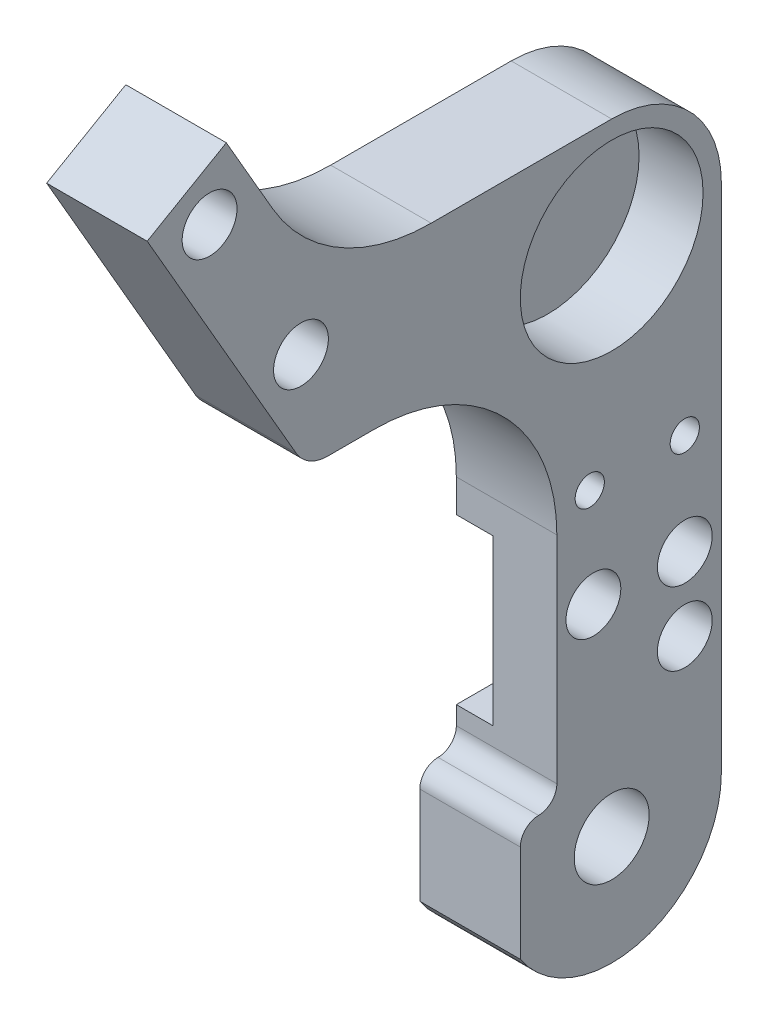
ISO-10303-21;
HEADER;
FILE_DESCRIPTION(('STEP AP214'),'2;1');
FILE_NAME('part.step','',(''),(''),'','','');
FILE_SCHEMA(('AUTOMOTIVE_DESIGN { 1 0 10303 214 1 1 1 1 }'));
ENDSEC;
DATA;
#1=APPLICATION_CONTEXT('core data for automotive mechanical design processes');
#2=APPLICATION_PROTOCOL_DEFINITION('international standard','automotive_design',2000,#1);
#3=PRODUCT_CONTEXT('',#1,'mechanical');
#4=PRODUCT('Part','Part','',(#3));
#5=PRODUCT_RELATED_PRODUCT_CATEGORY('part','',(#4));
#6=PRODUCT_DEFINITION_FORMATION('','',#4);
#7=PRODUCT_DEFINITION_CONTEXT('part definition',#1,'design');
#8=PRODUCT_DEFINITION('design','',#6,#7);
#9=PRODUCT_DEFINITION_SHAPE('','',#8);
#10=(LENGTH_UNIT() NAMED_UNIT(*) SI_UNIT(.MILLI.,.METRE.));
#11=(NAMED_UNIT(*) PLANE_ANGLE_UNIT() SI_UNIT($,.RADIAN.));
#12=(NAMED_UNIT(*) SI_UNIT($,.STERADIAN.) SOLID_ANGLE_UNIT());
#13=UNCERTAINTY_MEASURE_WITH_UNIT(LENGTH_MEASURE(1.E-05),#10,'distance_accuracy_value','');
#14=(GEOMETRIC_REPRESENTATION_CONTEXT(3) GLOBAL_UNCERTAINTY_ASSIGNED_CONTEXT((#13)) GLOBAL_UNIT_ASSIGNED_CONTEXT((#10,
#11,#12)) REPRESENTATION_CONTEXT('',''));
#15=CARTESIAN_POINT('',(0.,0.,0.));
#16=DIRECTION('',(0.,0.,1.));
#17=DIRECTION('',(1.,0.,0.));
#18=AXIS2_PLACEMENT_3D('',#15,#16,#17);
#19=CARTESIAN_POINT('',(0.,0.,0.));
#20=DIRECTION('',(-1.,0.,0.));
#21=DIRECTION('',(0.,0.,1.));
#22=AXIS2_PLACEMENT_3D('',#19,#20,#21);
#23=PLANE('',#22);
#24=DIRECTION('',(0.,0.,-1.));
#25=VECTOR('',#24,1.);
#26=CARTESIAN_POINT('',(0.,14.,-6.));
#27=LINE('',#26,#25);
#28=CARTESIAN_POINT('',(0.,14.,3.));
#29=VERTEX_POINT('',#28);
#30=CARTESIAN_POINT('',(0.,14.,-6.));
#31=VERTEX_POINT('',#30);
#32=EDGE_CURVE('E184',#29,#31,#27,.T.);
#33=ORIENTED_EDGE('',*,*,#32,.F.);
#34=DIRECTION('',(0.,-1.,0.));
#35=VECTOR('',#34,1.);
#36=CARTESIAN_POINT('',(0.,15.7901891737369,3.));
#37=LINE('',#36,#35);
#38=CARTESIAN_POINT('',(0.,15.7901891737369,3.));
#39=VERTEX_POINT('',#38);
#40=EDGE_CURVE('E295',#39,#29,#37,.T.);
#41=ORIENTED_EDGE('',*,*,#40,.F.);
#42=CARTESIAN_POINT('',(0.,15.7901891737369,13.));
#43=DIRECTION('',(-1.,0.,0.));
#44=DIRECTION('',(0.,0.,1.));
#45=AXIS2_PLACEMENT_3D('',#42,#43,#44);
#46=CIRCLE('',#45,10.);
#47=CARTESIAN_POINT('',(0.,25.7901891737369,13.));
#48=VERTEX_POINT('',#47);
#49=EDGE_CURVE('E292',#48,#39,#46,.T.);
#50=ORIENTED_EDGE('',*,*,#49,.F.);
#51=DIRECTION('',(0.,0.,-1.));
#52=VECTOR('',#51,1.);
#53=CARTESIAN_POINT('',(0.,25.7901891737369,15.5280127018922));
#54=LINE('',#53,#52);
#55=CARTESIAN_POINT('',(0.,25.7901891737369,15.5280127018922));
#56=VERTEX_POINT('',#55);
#57=EDGE_CURVE('E290',#56,#48,#54,.T.);
#58=ORIENTED_EDGE('',*,*,#57,.F.);
#59=CARTESIAN_POINT('',(0.,27.7901891737369,15.5280127018922));
#60=DIRECTION('',(1.,0.,0.));
#61=DIRECTION('',(0.,0.,-1.));
#62=AXIS2_PLACEMENT_3D('',#59,#60,#61);
#63=CIRCLE('',#62,2.00000000000001);
#64=CARTESIAN_POINT('',(0.,26.7901891737369,17.260063509461));
#65=VERTEX_POINT('',#64);
#66=EDGE_CURVE('E288',#65,#56,#63,.T.);
#67=ORIENTED_EDGE('',*,*,#66,.F.);
#68=DIRECTION('',(0.,-0.866025403784436,-0.500000000000004));
#69=VECTOR('',#68,1.);
#70=CARTESIAN_POINT('',(0.,40.9150635094611,25.4150635094611));
#71=LINE('',#70,#69);
#72=CARTESIAN_POINT('',(0.,40.9150635094611,25.4150635094611));
#73=VERTEX_POINT('',#72);
#74=EDGE_CURVE('E286',#73,#65,#71,.T.);
#75=ORIENTED_EDGE('',*,*,#74,.F.);
#76=DIRECTION('',(0.,-0.500000000000004,0.866025403784436));
#77=VECTOR('',#76,1.);
#78=CARTESIAN_POINT('',(0.,43.4150635094611,21.0849364905389));
#79=LINE('',#78,#77);
#80=CARTESIAN_POINT('',(0.,43.4150635094611,21.0849364905389));
#81=VERTEX_POINT('',#80);
#82=EDGE_CURVE('E284',#81,#73,#79,.T.);
#83=ORIENTED_EDGE('',*,*,#82,.F.);
#84=DIRECTION('',(0.,0.866025403784437,0.500000000000003));
#85=VECTOR('',#84,1.);
#86=CARTESIAN_POINT('',(0.,39.,18.5358983848622));
#87=LINE('',#86,#85);
#88=CARTESIAN_POINT('',(0.,39.,18.5358983848622));
#89=VERTEX_POINT('',#88);
#90=EDGE_CURVE('E282',#89,#81,#87,.T.);
#91=ORIENTED_EDGE('',*,*,#90,.F.);
#92=CARTESIAN_POINT('',(0.,44.,9.87564434701784));
#93=DIRECTION('',(-1.,0.,0.));
#94=DIRECTION('',(0.,0.,1.));
#95=AXIS2_PLACEMENT_3D('',#92,#93,#94);
#96=CIRCLE('',#95,10.);
#97=CARTESIAN_POINT('',(0.,34.,9.87564434701784));
#98=VERTEX_POINT('',#97);
#99=EDGE_CURVE('E280',#98,#89,#96,.T.);
#100=ORIENTED_EDGE('',*,*,#99,.F.);
#101=DIRECTION('',(0.,0.,1.));
#102=VECTOR('',#101,1.);
#103=CARTESIAN_POINT('',(0.,34.,0.));
#104=LINE('',#103,#102);
#105=CARTESIAN_POINT('',(0.,34.,0.));
#106=VERTEX_POINT('',#105);
#107=EDGE_CURVE('E278',#106,#98,#104,.T.);
#108=ORIENTED_EDGE('',*,*,#107,.F.);
#109=CARTESIAN_POINT('',(0.,28.,0.));
#110=DIRECTION('',(1.,0.,0.));
#111=DIRECTION('',(0.,0.,-1.));
#112=AXIS2_PLACEMENT_3D('',#109,#110,#111);
#113=CIRCLE('',#112,6.);
#114=CARTESIAN_POINT('',(0.,28.,-6.));
#115=VERTEX_POINT('',#114);
#116=EDGE_CURVE('E276',#115,#106,#113,.T.);
#117=ORIENTED_EDGE('',*,*,#116,.F.);
#118=DIRECTION('',(0.,1.,0.));
#119=VECTOR('',#118,1.);
#120=CARTESIAN_POINT('',(0.,0.,-6.));
#121=LINE('',#120,#119);
#122=EDGE_CURVE('E274',#31,#115,#121,.T.);
#123=ORIENTED_EDGE('',*,*,#122,.F.);
#124=EDGE_LOOP('',(#33,#41,#50,#58,#67,#75,#83,#91,#100,#108,#117,#123));
#125=FACE_BOUND('',#124,.T.);
#126=CARTESIAN_POINT('',(0.,40.,22.));
#127=DIRECTION('',(1.,0.,0.));
#128=DIRECTION('',(0.,0.,-1.));
#129=AXIS2_PLACEMENT_3D('',#126,#127,#128);
#130=CIRCLE('',#129,1.5);
#131=CARTESIAN_POINT('',(0.,40.,20.5));
#132=VERTEX_POINT('',#131);
#133=EDGE_CURVE('E228',#132,#132,#130,.T.);
#134=ORIENTED_EDGE('',*,*,#133,.T.);
#135=EDGE_LOOP('',(#134));
#136=FACE_BOUND('',#135,.T.);
#137=CARTESIAN_POINT('',(0.,31.3397459621556,17.));
#138=DIRECTION('',(1.,0.,0.));
#139=DIRECTION('',(0.,0.,-1.));
#140=AXIS2_PLACEMENT_3D('',#137,#138,#139);
#141=CIRCLE('',#140,1.5);
#142=CARTESIAN_POINT('',(0.,31.3397459621556,15.5));
#143=VERTEX_POINT('',#142);
#144=EDGE_CURVE('E224',#143,#143,#141,.T.);
#145=ORIENTED_EDGE('',*,*,#144,.T.);
#146=EDGE_LOOP('',(#145));
#147=FACE_BOUND('',#146,.T.);
#148=CARTESIAN_POINT('',(0.,17.,-4.));
#149=DIRECTION('',(-1.,0.,0.));
#150=DIRECTION('',(0.,0.,1.));
#151=AXIS2_PLACEMENT_3D('',#148,#149,#150);
#152=CIRCLE('',#151,0.799999999999993);
#153=CARTESIAN_POINT('',(0.,17.,-3.20000000000001));
#154=VERTEX_POINT('',#153);
#155=EDGE_CURVE('E211',#154,#154,#152,.T.);
#156=ORIENTED_EDGE('',*,*,#155,.F.);
#157=EDGE_LOOP('',(#156));
#158=FACE_BOUND('',#157,.T.);
#159=CARTESIAN_POINT('',(0.,17.,1.2));
#160=DIRECTION('',(-1.,0.,0.));
#161=DIRECTION('',(0.,0.,1.));
#162=AXIS2_PLACEMENT_3D('',#159,#160,#161);
#163=CIRCLE('',#162,0.799999999999993);
#164=CARTESIAN_POINT('',(0.,17.,1.99999999999999));
#165=VERTEX_POINT('',#164);
#166=EDGE_CURVE('E205',#165,#165,#163,.T.);
#167=ORIENTED_EDGE('',*,*,#166,.F.);
#168=EDGE_LOOP('',(#167));
#169=FACE_BOUND('',#168,.T.);
#170=ADVANCED_FACE('F37',(#125,#136,#147,#158,#169),#23,.T.);
#171=CARTESIAN_POINT('',(5.5,0.,0.));
#172=DIRECTION('',(-1.,0.,0.));
#173=DIRECTION('',(0.,0.,1.));
#174=AXIS2_PLACEMENT_3D('',#171,#172,#173);
#175=PLANE('',#174);
#176=CARTESIAN_POINT('',(5.5,28.,0.));
#177=DIRECTION('',(1.,0.,0.));
#178=DIRECTION('',(0.,0.,-1.));
#179=AXIS2_PLACEMENT_3D('',#176,#177,#178);
#180=CIRCLE('',#179,5.);
#181=CARTESIAN_POINT('',(5.5,28.,-5.));
#182=VERTEX_POINT('',#181);
#183=EDGE_CURVE('E694',#182,#182,#180,.T.);
#184=ORIENTED_EDGE('',*,*,#183,.F.);
#185=EDGE_LOOP('',(#184));
#186=FACE_BOUND('',#185,.T.);
#187=CARTESIAN_POINT('',(5.5,17.,-4.));
#188=DIRECTION('',(1.,0.,0.));
#189=DIRECTION('',(0.,0.,-1.));
#190=AXIS2_PLACEMENT_3D('',#187,#188,#189);
#191=CIRCLE('',#190,0.799999999999988);
#192=CARTESIAN_POINT('',(5.5,17.,-4.79999999999999));
#193=VERTEX_POINT('',#192);
#194=EDGE_CURVE('E208',#193,#193,#191,.T.);
#195=ORIENTED_EDGE('',*,*,#194,.F.);
#196=EDGE_LOOP('',(#195));
#197=FACE_BOUND('',#196,.T.);
#198=CARTESIAN_POINT('',(5.5,11.5,-4.));
#199=DIRECTION('',(1.,0.,0.));
#200=DIRECTION('',(0.,0.,-1.));
#201=AXIS2_PLACEMENT_3D('',#198,#199,#200);
#202=CIRCLE('',#201,1.5);
#203=CARTESIAN_POINT('',(5.5,11.5,-5.5));
#204=VERTEX_POINT('',#203);
#205=EDGE_CURVE('E218',#204,#204,#202,.T.);
#206=ORIENTED_EDGE('',*,*,#205,.F.);
#207=EDGE_LOOP('',(#206));
#208=FACE_BOUND('',#207,.T.);
#209=CARTESIAN_POINT('',(5.5,31.3397459621556,17.));
#210=DIRECTION('',(1.,0.,0.));
#211=DIRECTION('',(0.,0.,-1.));
#212=AXIS2_PLACEMENT_3D('',#209,#210,#211);
#213=CIRCLE('',#212,1.5);
#214=CARTESIAN_POINT('',(5.5,31.3397459621556,15.5));
#215=VERTEX_POINT('',#214);
#216=EDGE_CURVE('E225',#215,#215,#213,.T.);
#217=ORIENTED_EDGE('',*,*,#216,.F.);
#218=EDGE_LOOP('',(#217));
#219=FACE_BOUND('',#218,.T.);
#220=CARTESIAN_POINT('',(5.5,0.,0.));
#221=DIRECTION('',(1.,0.,0.));
#222=DIRECTION('',(0.,0.,-1.));
#223=AXIS2_PLACEMENT_3D('',#220,#221,#222);
#224=CIRCLE('',#223,2.05);
#225=CARTESIAN_POINT('',(5.5,0.,-2.05));
#226=VERTEX_POINT('',#225);
#227=EDGE_CURVE('E237',#226,#226,#224,.T.);
#228=ORIENTED_EDGE('',*,*,#227,.F.);
#229=EDGE_LOOP('',(#228));
#230=FACE_BOUND('',#229,.T.);
#231=DIRECTION('',(0.,-1.,0.));
#232=VECTOR('',#231,1.);
#233=CARTESIAN_POINT('',(5.5,15.7901891737369,3.));
#234=LINE('',#233,#232);
#235=CARTESIAN_POINT('',(5.5,15.7901891737369,3.));
#236=VERTEX_POINT('',#235);
#237=CARTESIAN_POINT('',(5.5,4.,3.));
#238=VERTEX_POINT('',#237);
#239=EDGE_CURVE('E267',#236,#238,#234,.T.);
#240=ORIENTED_EDGE('',*,*,#239,.T.);
#241=CARTESIAN_POINT('',(5.5,4.,4.));
#242=DIRECTION('',(-1.,0.,0.));
#243=DIRECTION('',(0.,0.,1.));
#244=AXIS2_PLACEMENT_3D('',#241,#242,#243);
#245=CIRCLE('',#244,1.);
#246=CARTESIAN_POINT('',(5.5,3.,4.));
#247=VERTEX_POINT('',#246);
#248=EDGE_CURVE('E11',#238,#247,#245,.T.);
#249=ORIENTED_EDGE('',*,*,#248,.T.);
#250=CARTESIAN_POINT('',(5.5,2.,4.));
#251=DIRECTION('',(-1.,0.,0.));
#252=DIRECTION('',(0.,0.,1.));
#253=AXIS2_PLACEMENT_3D('',#250,#251,#252);
#254=CIRCLE('',#253,1.);
#255=CARTESIAN_POINT('',(5.5,2.,5.));
#256=VERTEX_POINT('',#255);
#257=EDGE_CURVE('E338',#247,#256,#254,.F.);
#258=ORIENTED_EDGE('',*,*,#257,.T.);
#259=DIRECTION('',(0.,-1.,0.));
#260=VECTOR('',#259,1.);
#261=CARTESIAN_POINT('',(5.5,3.,5.));
#262=LINE('',#261,#260);
#263=CARTESIAN_POINT('',(5.5,-3.3166247903554,5.));
#264=VERTEX_POINT('',#263);
#265=EDGE_CURVE('E269',#256,#264,#262,.T.);
#266=ORIENTED_EDGE('',*,*,#265,.T.);
#267=CARTESIAN_POINT('',(5.5,0.,0.));
#268=DIRECTION('',(1.,0.,0.));
#269=DIRECTION('',(0.,0.,1.));
#270=AXIS2_PLACEMENT_3D('',#267,#268,#269);
#271=CIRCLE('',#270,6.);
#272=CARTESIAN_POINT('',(5.5,0.,-6.));
#273=VERTEX_POINT('',#272);
#274=EDGE_CURVE('E243',#264,#273,#271,.T.);
#275=ORIENTED_EDGE('',*,*,#274,.T.);
#276=DIRECTION('',(0.,1.,0.));
#277=VECTOR('',#276,1.);
#278=CARTESIAN_POINT('',(5.5,0.,-6.));
#279=LINE('',#278,#277);
#280=CARTESIAN_POINT('',(5.5,28.,-6.));
#281=VERTEX_POINT('',#280);
#282=EDGE_CURVE('E246',#273,#281,#279,.T.);
#283=ORIENTED_EDGE('',*,*,#282,.T.);
#284=CARTESIAN_POINT('',(5.5,28.,0.));
#285=DIRECTION('',(1.,0.,0.));
#286=DIRECTION('',(0.,0.,-1.));
#287=AXIS2_PLACEMENT_3D('',#284,#285,#286);
#288=CIRCLE('',#287,6.);
#289=CARTESIAN_POINT('',(5.5,34.,0.));
#290=VERTEX_POINT('',#289);
#291=EDGE_CURVE('E249',#281,#290,#288,.T.);
#292=ORIENTED_EDGE('',*,*,#291,.T.);
#293=DIRECTION('',(0.,0.,1.));
#294=VECTOR('',#293,1.);
#295=CARTESIAN_POINT('',(5.5,34.,0.));
#296=LINE('',#295,#294);
#297=CARTESIAN_POINT('',(5.5,34.,9.87564434701784));
#298=VERTEX_POINT('',#297);
#299=EDGE_CURVE('E251',#290,#298,#296,.T.);
#300=ORIENTED_EDGE('',*,*,#299,.T.);
#301=CARTESIAN_POINT('',(5.5,44.,9.87564434701784));
#302=DIRECTION('',(-1.,0.,0.));
#303=DIRECTION('',(0.,0.,1.));
#304=AXIS2_PLACEMENT_3D('',#301,#302,#303);
#305=CIRCLE('',#304,10.);
#306=CARTESIAN_POINT('',(5.5,39.,18.5358983848622));
#307=VERTEX_POINT('',#306);
#308=EDGE_CURVE('E253',#298,#307,#305,.T.);
#309=ORIENTED_EDGE('',*,*,#308,.T.);
#310=DIRECTION('',(0.,0.866025403784437,0.500000000000003));
#311=VECTOR('',#310,1.);
#312=CARTESIAN_POINT('',(5.5,39.,18.5358983848622));
#313=LINE('',#312,#311);
#314=CARTESIAN_POINT('',(5.5,43.4150635094611,21.0849364905389));
#315=VERTEX_POINT('',#314);
#316=EDGE_CURVE('E255',#307,#315,#313,.T.);
#317=ORIENTED_EDGE('',*,*,#316,.T.);
#318=DIRECTION('',(0.,-0.500000000000004,0.866025403784436));
#319=VECTOR('',#318,1.);
#320=CARTESIAN_POINT('',(5.5,43.4150635094611,21.0849364905389));
#321=LINE('',#320,#319);
#322=CARTESIAN_POINT('',(5.5,40.9150635094611,25.4150635094611));
#323=VERTEX_POINT('',#322);
#324=EDGE_CURVE('E257',#315,#323,#321,.T.);
#325=ORIENTED_EDGE('',*,*,#324,.T.);
#326=DIRECTION('',(0.,-0.866025403784436,-0.500000000000004));
#327=VECTOR('',#326,1.);
#328=CARTESIAN_POINT('',(5.5,40.9150635094611,25.4150635094611));
#329=LINE('',#328,#327);
#330=CARTESIAN_POINT('',(5.5,26.7901891737369,17.260063509461));
#331=VERTEX_POINT('',#330);
#332=EDGE_CURVE('E259',#323,#331,#329,.T.);
#333=ORIENTED_EDGE('',*,*,#332,.T.);
#334=CARTESIAN_POINT('',(5.5,27.7901891737369,15.5280127018922));
#335=DIRECTION('',(1.,0.,0.));
#336=DIRECTION('',(0.,0.,-1.));
#337=AXIS2_PLACEMENT_3D('',#334,#335,#336);
#338=CIRCLE('',#337,2.00000000000001);
#339=CARTESIAN_POINT('',(5.5,25.7901891737369,15.5280127018922));
#340=VERTEX_POINT('',#339);
#341=EDGE_CURVE('E261',#331,#340,#338,.T.);
#342=ORIENTED_EDGE('',*,*,#341,.T.);
#343=DIRECTION('',(0.,0.,-1.));
#344=VECTOR('',#343,1.);
#345=CARTESIAN_POINT('',(5.5,25.7901891737369,15.5280127018922));
#346=LINE('',#345,#344);
#347=CARTESIAN_POINT('',(5.5,25.7901891737369,13.));
#348=VERTEX_POINT('',#347);
#349=EDGE_CURVE('E263',#340,#348,#346,.T.);
#350=ORIENTED_EDGE('',*,*,#349,.T.);
#351=CARTESIAN_POINT('',(5.5,15.7901891737369,13.));
#352=DIRECTION('',(-1.,0.,0.));
#353=DIRECTION('',(0.,0.,1.));
#354=AXIS2_PLACEMENT_3D('',#351,#352,#353);
#355=CIRCLE('',#354,10.);
#356=EDGE_CURVE('E265',#348,#236,#355,.T.);
#357=ORIENTED_EDGE('',*,*,#356,.T.);
#358=EDGE_LOOP('',(#240,#249,#258,#266,#275,#283,#292,#300,#309,#317,#325,#333,#342,#350,#357));
#359=FACE_BOUND('',#358,.T.);
#360=CARTESIAN_POINT('',(5.5,40.,22.));
#361=DIRECTION('',(1.,0.,0.));
#362=DIRECTION('',(0.,0.,-1.));
#363=AXIS2_PLACEMENT_3D('',#360,#361,#362);
#364=CIRCLE('',#363,1.5);
#365=CARTESIAN_POINT('',(5.5,40.,20.5));
#366=VERTEX_POINT('',#365);
#367=EDGE_CURVE('E231',#366,#366,#364,.T.);
#368=ORIENTED_EDGE('',*,*,#367,.F.);
#369=EDGE_LOOP('',(#368));
#370=FACE_BOUND('',#369,.T.);
#371=CARTESIAN_POINT('',(5.5,11.5,1.));
#372=DIRECTION('',(1.,0.,0.));
#373=DIRECTION('',(0.,0.,-1.));
#374=AXIS2_PLACEMENT_3D('',#371,#372,#373);
#375=CIRCLE('',#374,1.5);
#376=CARTESIAN_POINT('',(5.5,11.5,-0.5));
#377=VERTEX_POINT('',#376);
#378=EDGE_CURVE('E221',#377,#377,#375,.T.);
#379=ORIENTED_EDGE('',*,*,#378,.F.);
#380=EDGE_LOOP('',(#379));
#381=FACE_BOUND('',#380,.T.);
#382=CARTESIAN_POINT('',(5.5,7.5,-4.));
#383=DIRECTION('',(1.,0.,0.));
#384=DIRECTION('',(0.,0.,-1.));
#385=AXIS2_PLACEMENT_3D('',#382,#383,#384);
#386=CIRCLE('',#385,1.5);
#387=CARTESIAN_POINT('',(5.5,7.5,-5.5));
#388=VERTEX_POINT('',#387);
#389=EDGE_CURVE('E215',#388,#388,#386,.T.);
#390=ORIENTED_EDGE('',*,*,#389,.F.);
#391=EDGE_LOOP('',(#390));
#392=FACE_BOUND('',#391,.T.);
#393=CARTESIAN_POINT('',(5.5,17.,1.2));
#394=DIRECTION('',(1.,0.,0.));
#395=DIRECTION('',(0.,0.,-1.));
#396=AXIS2_PLACEMENT_3D('',#393,#394,#395);
#397=CIRCLE('',#396,0.799999999999988);
#398=CARTESIAN_POINT('',(5.5,17.,0.400000000000011));
#399=VERTEX_POINT('',#398);
#400=EDGE_CURVE('E202',#399,#399,#397,.T.);
#401=ORIENTED_EDGE('',*,*,#400,.F.);
#402=EDGE_LOOP('',(#401));
#403=FACE_BOUND('',#402,.T.);
#404=ADVANCED_FACE('F365',(#186,#197,#208,#219,#230,#359,#370,#381,#392,#403),#175,.F.);
#405=DIRECTION('',(0.,0.,1.));
#406=VECTOR('',#405,1.);
#407=CARTESIAN_POINT('',(0.,5.,-6.));
#408=LINE('',#407,#406);
#409=CARTESIAN_POINT('',(0.,5.,-6.));
#410=VERTEX_POINT('',#409);
#411=CARTESIAN_POINT('',(0.,5.,3.));
#412=VERTEX_POINT('',#411);
#413=EDGE_CURVE('E421',#410,#412,#408,.T.);
#414=ORIENTED_EDGE('',*,*,#413,.F.);
#415=CARTESIAN_POINT('',(0.,0.,-6.));
#416=VERTEX_POINT('',#415);
#417=EDGE_CURVE('E189',#416,#410,#121,.T.);
#418=ORIENTED_EDGE('',*,*,#417,.F.);
#419=CARTESIAN_POINT('',(0.,0.,0.));
#420=DIRECTION('',(1.,0.,0.));
#421=DIRECTION('',(0.,0.,1.));
#422=AXIS2_PLACEMENT_3D('',#419,#420,#421);
#423=CIRCLE('',#422,6.);
#424=CARTESIAN_POINT('',(0.,-3.3166247903554,5.));
#425=VERTEX_POINT('',#424);
#426=EDGE_CURVE('E240',#425,#416,#423,.T.);
#427=ORIENTED_EDGE('',*,*,#426,.F.);
#428=DIRECTION('',(0.,-1.,0.));
#429=VECTOR('',#428,1.);
#430=CARTESIAN_POINT('',(0.,3.,5.));
#431=LINE('',#430,#429);
#432=CARTESIAN_POINT('',(0.,2.,5.));
#433=VERTEX_POINT('',#432);
#434=EDGE_CURVE('E247',#433,#425,#431,.T.);
#435=ORIENTED_EDGE('',*,*,#434,.F.);
#436=CARTESIAN_POINT('',(0.,2.,4.));
#437=DIRECTION('',(-1.,0.,0.));
#438=DIRECTION('',(0.,0.,1.));
#439=AXIS2_PLACEMENT_3D('',#436,#437,#438);
#440=CIRCLE('',#439,1.);
#441=CARTESIAN_POINT('',(0.,3.,4.));
#442=VERTEX_POINT('',#441);
#443=EDGE_CURVE('E336',#433,#442,#440,.T.);
#444=ORIENTED_EDGE('',*,*,#443,.T.);
#445=CARTESIAN_POINT('',(0.,4.,4.));
#446=DIRECTION('',(-1.,0.,0.));
#447=DIRECTION('',(0.,0.,1.));
#448=AXIS2_PLACEMENT_3D('',#445,#446,#447);
#449=CIRCLE('',#448,1.);
#450=CARTESIAN_POINT('',(0.,4.,3.));
#451=VERTEX_POINT('',#450);
#452=EDGE_CURVE('E46',#442,#451,#449,.F.);
#453=ORIENTED_EDGE('',*,*,#452,.T.);
#454=EDGE_CURVE('E294',#412,#451,#37,.T.);
#455=ORIENTED_EDGE('',*,*,#454,.F.);
#456=EDGE_LOOP('',(#414,#418,#427,#435,#444,#453,#455));
#457=FACE_BOUND('',#456,.T.);
#458=CARTESIAN_POINT('',(0.,0.,0.));
#459=DIRECTION('',(1.,0.,0.));
#460=DIRECTION('',(0.,0.,-1.));
#461=AXIS2_PLACEMENT_3D('',#458,#459,#460);
#462=CIRCLE('',#461,2.05);
#463=CARTESIAN_POINT('',(0.,0.,-2.05));
#464=VERTEX_POINT('',#463);
#465=EDGE_CURVE('E234',#464,#464,#462,.T.);
#466=ORIENTED_EDGE('',*,*,#465,.T.);
#467=EDGE_LOOP('',(#466));
#468=FACE_BOUND('',#467,.T.);
#469=ADVANCED_FACE('F353',(#457,#468),#23,.T.);
#470=CARTESIAN_POINT('',(5.5,0.,0.));
#471=DIRECTION('',(-1.,0.,0.));
#472=DIRECTION('',(0.,0.,1.));
#473=AXIS2_PLACEMENT_3D('',#470,#471,#472);
#474=CYLINDRICAL_SURFACE('',#473,6.);
#475=ORIENTED_EDGE('',*,*,#426,.T.);
#476=DIRECTION('',(-1.,0.,0.));
#477=VECTOR('',#476,1.);
#478=CARTESIAN_POINT('',(5.5,0.,-6.));
#479=LINE('',#478,#477);
#480=EDGE_CURVE('E331',#273,#416,#479,.T.);
#481=ORIENTED_EDGE('',*,*,#480,.F.);
#482=ORIENTED_EDGE('',*,*,#274,.F.);
#483=DIRECTION('',(-1.,0.,0.));
#484=VECTOR('',#483,1.);
#485=CARTESIAN_POINT('',(5.5,-3.3166247903554,5.));
#486=LINE('',#485,#484);
#487=EDGE_CURVE('E271',#264,#425,#486,.T.);
#488=ORIENTED_EDGE('',*,*,#487,.T.);
#489=EDGE_LOOP('',(#475,#481,#482,#488));
#490=FACE_BOUND('',#489,.T.);
#491=ADVANCED_FACE('F363',(#490),#474,.T.);
#492=CARTESIAN_POINT('',(5.5,0.,-6.));
#493=DIRECTION('',(0.,0.,1.));
#494=DIRECTION('',(0.,-1.,0.));
#495=AXIS2_PLACEMENT_3D('',#492,#493,#494);
#496=PLANE('',#495);
#497=DIRECTION('',(0.,-1.,0.));
#498=VECTOR('',#497,1.);
#499=CARTESIAN_POINT('',(2.,5.,-6.));
#500=LINE('',#499,#498);
#501=CARTESIAN_POINT('',(2.,14.,-6.));
#502=VERTEX_POINT('',#501);
#503=CARTESIAN_POINT('',(2.,5.,-6.));
#504=VERTEX_POINT('',#503);
#505=EDGE_CURVE('E175',#502,#504,#500,.T.);
#506=ORIENTED_EDGE('',*,*,#505,.F.);
#507=DIRECTION('',(-1.,0.,0.));
#508=VECTOR('',#507,1.);
#509=CARTESIAN_POINT('',(2.,14.,-6.));
#510=LINE('',#509,#508);
#511=EDGE_CURVE('E425',#502,#31,#510,.T.);
#512=ORIENTED_EDGE('',*,*,#511,.T.);
#513=ORIENTED_EDGE('',*,*,#122,.T.);
#514=DIRECTION('',(-1.,0.,0.));
#515=VECTOR('',#514,1.);
#516=CARTESIAN_POINT('',(5.5,28.,-6.));
#517=LINE('',#516,#515);
#518=EDGE_CURVE('E328',#281,#115,#517,.T.);
#519=ORIENTED_EDGE('',*,*,#518,.F.);
#520=ORIENTED_EDGE('',*,*,#282,.F.);
#521=ORIENTED_EDGE('',*,*,#480,.T.);
#522=ORIENTED_EDGE('',*,*,#417,.T.);
#523=DIRECTION('',(-1.,0.,0.));
#524=VECTOR('',#523,1.);
#525=CARTESIAN_POINT('',(2.,5.,-6.));
#526=LINE('',#525,#524);
#527=EDGE_CURVE('E169',#504,#410,#526,.T.);
#528=ORIENTED_EDGE('',*,*,#527,.F.);
#529=EDGE_LOOP('',(#506,#512,#513,#519,#520,#521,#522,#528));
#530=FACE_BOUND('',#529,.T.);
#531=ADVANCED_FACE('F187',(#530),#496,.F.);
#532=CARTESIAN_POINT('',(5.5,28.,0.));
#533=DIRECTION('',(-1.,0.,0.));
#534=DIRECTION('',(0.,0.,1.));
#535=AXIS2_PLACEMENT_3D('',#532,#533,#534);
#536=CYLINDRICAL_SURFACE('',#535,6.);
#537=ORIENTED_EDGE('',*,*,#116,.T.);
#538=DIRECTION('',(-1.,0.,0.));
#539=VECTOR('',#538,1.);
#540=CARTESIAN_POINT('',(5.5,34.,0.));
#541=LINE('',#540,#539);
#542=EDGE_CURVE('E325',#290,#106,#541,.T.);
#543=ORIENTED_EDGE('',*,*,#542,.F.);
#544=ORIENTED_EDGE('',*,*,#291,.F.);
#545=ORIENTED_EDGE('',*,*,#518,.T.);
#546=EDGE_LOOP('',(#537,#543,#544,#545));
#547=FACE_BOUND('',#546,.T.);
#548=ADVANCED_FACE('F373',(#547),#536,.T.);
#549=CARTESIAN_POINT('',(5.5,34.,0.));
#550=DIRECTION('',(0.,-1.,0.));
#551=DIRECTION('',(0.,0.,-1.));
#552=AXIS2_PLACEMENT_3D('',#549,#550,#551);
#553=PLANE('',#552);
#554=ORIENTED_EDGE('',*,*,#107,.T.);
#555=DIRECTION('',(-1.,0.,0.));
#556=VECTOR('',#555,1.);
#557=CARTESIAN_POINT('',(5.5,34.,9.87564434701784));
#558=LINE('',#557,#556);
#559=EDGE_CURVE('E322',#298,#98,#558,.T.);
#560=ORIENTED_EDGE('',*,*,#559,.F.);
#561=ORIENTED_EDGE('',*,*,#299,.F.);
#562=ORIENTED_EDGE('',*,*,#542,.T.);
#563=EDGE_LOOP('',(#554,#560,#561,#562));
#564=FACE_BOUND('',#563,.T.);
#565=ADVANCED_FACE('F378',(#564),#553,.F.);
#566=CARTESIAN_POINT('',(5.5,44.,9.87564434701784));
#567=DIRECTION('',(-1.,0.,0.));
#568=DIRECTION('',(0.,0.,1.));
#569=AXIS2_PLACEMENT_3D('',#566,#567,#568);
#570=CYLINDRICAL_SURFACE('',#569,10.);
#571=ORIENTED_EDGE('',*,*,#99,.T.);
#572=DIRECTION('',(-1.,0.,0.));
#573=VECTOR('',#572,1.);
#574=CARTESIAN_POINT('',(5.5,39.,18.5358983848622));
#575=LINE('',#574,#573);
#576=EDGE_CURVE('E319',#307,#89,#575,.T.);
#577=ORIENTED_EDGE('',*,*,#576,.F.);
#578=ORIENTED_EDGE('',*,*,#308,.F.);
#579=ORIENTED_EDGE('',*,*,#559,.T.);
#580=EDGE_LOOP('',(#571,#577,#578,#579));
#581=FACE_BOUND('',#580,.T.);
#582=ADVANCED_FACE('F384',(#581),#570,.F.);
#583=CARTESIAN_POINT('',(5.5,39.,18.5358983848622));
#584=DIRECTION('',(0.,-0.500000000000003,0.866025403784437));
#585=DIRECTION('',(0.,-0.866025403784437,-0.500000000000003));
#586=AXIS2_PLACEMENT_3D('',#583,#584,#585);
#587=PLANE('',#586);
#588=ORIENTED_EDGE('',*,*,#90,.T.);
#589=DIRECTION('',(-1.,0.,0.));
#590=VECTOR('',#589,1.);
#591=CARTESIAN_POINT('',(5.5,43.4150635094611,21.0849364905389));
#592=LINE('',#591,#590);
#593=EDGE_CURVE('E316',#315,#81,#592,.T.);
#594=ORIENTED_EDGE('',*,*,#593,.F.);
#595=ORIENTED_EDGE('',*,*,#316,.F.);
#596=ORIENTED_EDGE('',*,*,#576,.T.);
#597=EDGE_LOOP('',(#588,#594,#595,#596));
#598=FACE_BOUND('',#597,.T.);
#599=ADVANCED_FACE('F388',(#598),#587,.F.);
#600=CARTESIAN_POINT('',(5.5,43.4150635094611,21.0849364905389));
#601=DIRECTION('',(0.,-0.866025403784436,-0.500000000000004));
#602=DIRECTION('',(0.,0.500000000000004,-0.866025403784436));
#603=AXIS2_PLACEMENT_3D('',#600,#601,#602);
#604=PLANE('',#603);
#605=ORIENTED_EDGE('',*,*,#82,.T.);
#606=DIRECTION('',(-1.,0.,0.));
#607=VECTOR('',#606,1.);
#608=CARTESIAN_POINT('',(5.5,40.9150635094611,25.4150635094611));
#609=LINE('',#608,#607);
#610=EDGE_CURVE('E313',#323,#73,#609,.T.);
#611=ORIENTED_EDGE('',*,*,#610,.F.);
#612=ORIENTED_EDGE('',*,*,#324,.F.);
#613=ORIENTED_EDGE('',*,*,#593,.T.);
#614=EDGE_LOOP('',(#605,#611,#612,#613));
#615=FACE_BOUND('',#614,.T.);
#616=ADVANCED_FACE('F393',(#615),#604,.F.);
#617=CARTESIAN_POINT('',(5.5,40.9150635094611,25.4150635094611));
#618=DIRECTION('',(0.,0.500000000000004,-0.866025403784436));
#619=DIRECTION('',(0.,0.866025403784436,0.500000000000004));
#620=AXIS2_PLACEMENT_3D('',#617,#618,#619);
#621=PLANE('',#620);
#622=ORIENTED_EDGE('',*,*,#74,.T.);
#623=DIRECTION('',(-1.,0.,0.));
#624=VECTOR('',#623,1.);
#625=CARTESIAN_POINT('',(5.5,26.7901891737369,17.260063509461));
#626=LINE('',#625,#624);
#627=EDGE_CURVE('E310',#331,#65,#626,.T.);
#628=ORIENTED_EDGE('',*,*,#627,.F.);
#629=ORIENTED_EDGE('',*,*,#332,.F.);
#630=ORIENTED_EDGE('',*,*,#610,.T.);
#631=EDGE_LOOP('',(#622,#628,#629,#630));
#632=FACE_BOUND('',#631,.T.);
#633=ADVANCED_FACE('F399',(#632),#621,.F.);
#634=CARTESIAN_POINT('',(5.5,27.7901891737369,15.5280127018922));
#635=DIRECTION('',(-1.,0.,0.));
#636=DIRECTION('',(0.,0.,1.));
#637=AXIS2_PLACEMENT_3D('',#634,#635,#636);
#638=CYLINDRICAL_SURFACE('',#637,2.00000000000001);
#639=ORIENTED_EDGE('',*,*,#66,.T.);
#640=DIRECTION('',(-1.,0.,0.));
#641=VECTOR('',#640,1.);
#642=CARTESIAN_POINT('',(5.5,25.7901891737369,15.5280127018922));
#643=LINE('',#642,#641);
#644=EDGE_CURVE('E307',#340,#56,#643,.T.);
#645=ORIENTED_EDGE('',*,*,#644,.F.);
#646=ORIENTED_EDGE('',*,*,#341,.F.);
#647=ORIENTED_EDGE('',*,*,#627,.T.);
#648=EDGE_LOOP('',(#639,#645,#646,#647));
#649=FACE_BOUND('',#648,.T.);
#650=ADVANCED_FACE('F403',(#649),#638,.T.);
#651=CARTESIAN_POINT('',(5.5,25.7901891737369,15.5280127018922));
#652=DIRECTION('',(0.,1.,0.));
#653=DIRECTION('',(0.,0.,1.));
#654=AXIS2_PLACEMENT_3D('',#651,#652,#653);
#655=PLANE('',#654);
#656=ORIENTED_EDGE('',*,*,#57,.T.);
#657=DIRECTION('',(-1.,0.,0.));
#658=VECTOR('',#657,1.);
#659=CARTESIAN_POINT('',(5.5,25.7901891737369,13.));
#660=LINE('',#659,#658);
#661=EDGE_CURVE('E304',#348,#48,#660,.T.);
#662=ORIENTED_EDGE('',*,*,#661,.F.);
#663=ORIENTED_EDGE('',*,*,#349,.F.);
#664=ORIENTED_EDGE('',*,*,#644,.T.);
#665=EDGE_LOOP('',(#656,#662,#663,#664));
#666=FACE_BOUND('',#665,.T.);
#667=ADVANCED_FACE('F408',(#666),#655,.F.);
#668=CARTESIAN_POINT('',(5.5,15.7901891737369,13.));
#669=DIRECTION('',(-1.,0.,0.));
#670=DIRECTION('',(0.,0.,1.));
#671=AXIS2_PLACEMENT_3D('',#668,#669,#670);
#672=CYLINDRICAL_SURFACE('',#671,10.);
#673=ORIENTED_EDGE('',*,*,#49,.T.);
#674=DIRECTION('',(-1.,0.,0.));
#675=VECTOR('',#674,1.);
#676=CARTESIAN_POINT('',(5.5,15.7901891737369,3.));
#677=LINE('',#676,#675);
#678=EDGE_CURVE('E301',#236,#39,#677,.T.);
#679=ORIENTED_EDGE('',*,*,#678,.F.);
#680=ORIENTED_EDGE('',*,*,#356,.F.);
#681=ORIENTED_EDGE('',*,*,#661,.T.);
#682=EDGE_LOOP('',(#673,#679,#680,#681));
#683=FACE_BOUND('',#682,.T.);
#684=ADVANCED_FACE('F413',(#683),#672,.F.);
#685=CARTESIAN_POINT('',(5.5,15.7901891737369,3.));
#686=DIRECTION('',(0.,0.,-1.));
#687=DIRECTION('',(0.,1.,0.));
#688=AXIS2_PLACEMENT_3D('',#685,#686,#687);
#689=PLANE('',#688);
#690=ORIENTED_EDGE('',*,*,#40,.T.);
#691=DIRECTION('',(-1.,0.,0.));
#692=VECTOR('',#691,1.);
#693=CARTESIAN_POINT('',(2.,14.,3.));
#694=LINE('',#693,#692);
#695=CARTESIAN_POINT('',(2.,14.,3.));
#696=VERTEX_POINT('',#695);
#697=EDGE_CURVE('E191',#696,#29,#694,.T.);
#698=ORIENTED_EDGE('',*,*,#697,.F.);
#699=DIRECTION('',(0.,1.,0.));
#700=VECTOR('',#699,1.);
#701=CARTESIAN_POINT('',(2.,5.,3.));
#702=LINE('',#701,#700);
#703=CARTESIAN_POINT('',(2.,5.,3.));
#704=VERTEX_POINT('',#703);
#705=EDGE_CURVE('E174',#704,#696,#702,.T.);
#706=ORIENTED_EDGE('',*,*,#705,.F.);
#707=DIRECTION('',(-1.,0.,0.));
#708=VECTOR('',#707,1.);
#709=CARTESIAN_POINT('',(2.,5.,3.));
#710=LINE('',#709,#708);
#711=EDGE_CURVE('E172',#704,#412,#710,.T.);
#712=ORIENTED_EDGE('',*,*,#711,.T.);
#713=ORIENTED_EDGE('',*,*,#454,.T.);
#714=DIRECTION('',(-1.,0.,0.));
#715=VECTOR('',#714,1.);
#716=CARTESIAN_POINT('',(5.5,4.,3.));
#717=LINE('',#716,#715);
#718=EDGE_CURVE('E340',#451,#238,#717,.F.);
#719=ORIENTED_EDGE('',*,*,#718,.T.);
#720=ORIENTED_EDGE('',*,*,#239,.F.);
#721=ORIENTED_EDGE('',*,*,#678,.T.);
#722=EDGE_LOOP('',(#690,#698,#706,#712,#713,#719,#720,#721));
#723=FACE_BOUND('',#722,.T.);
#724=ADVANCED_FACE('F417',(#723),#689,.F.);
#725=CARTESIAN_POINT('',(5.5,3.,5.));
#726=DIRECTION('',(0.,0.,-1.));
#727=DIRECTION('',(0.,1.,0.));
#728=AXIS2_PLACEMENT_3D('',#725,#726,#727);
#729=PLANE('',#728);
#730=ORIENTED_EDGE('',*,*,#265,.F.);
#731=DIRECTION('',(-1.,0.,0.));
#732=VECTOR('',#731,1.);
#733=CARTESIAN_POINT('',(5.5,2.,5.));
#734=LINE('',#733,#732);
#735=EDGE_CURVE('E333',#256,#433,#734,.T.);
#736=ORIENTED_EDGE('',*,*,#735,.T.);
#737=ORIENTED_EDGE('',*,*,#434,.T.);
#738=ORIENTED_EDGE('',*,*,#487,.F.);
#739=EDGE_LOOP('',(#730,#736,#737,#738));
#740=FACE_BOUND('',#739,.T.);
#741=ADVANCED_FACE('F360',(#740),#729,.F.);
#742=CARTESIAN_POINT('',(5.5,0.,0.));
#743=DIRECTION('',(-1.,0.,0.));
#744=DIRECTION('',(0.,0.,1.));
#745=AXIS2_PLACEMENT_3D('',#742,#743,#744);
#746=CYLINDRICAL_SURFACE('',#745,2.05);
#747=ORIENTED_EDGE('',*,*,#227,.T.);
#748=EDGE_LOOP('',(#747));
#749=FACE_BOUND('',#748,.T.);
#750=ORIENTED_EDGE('',*,*,#465,.F.);
#751=EDGE_LOOP('',(#750));
#752=FACE_BOUND('',#751,.T.);
#753=ADVANCED_FACE('F474',(#749,#752),#746,.F.);
#754=CARTESIAN_POINT('',(5.5,40.,22.));
#755=DIRECTION('',(-1.,0.,0.));
#756=DIRECTION('',(0.,0.,1.));
#757=AXIS2_PLACEMENT_3D('',#754,#755,#756);
#758=CYLINDRICAL_SURFACE('',#757,1.5);
#759=ORIENTED_EDGE('',*,*,#367,.T.);
#760=EDGE_LOOP('',(#759));
#761=FACE_BOUND('',#760,.T.);
#762=ORIENTED_EDGE('',*,*,#133,.F.);
#763=EDGE_LOOP('',(#762));
#764=FACE_BOUND('',#763,.T.);
#765=ADVANCED_FACE('F470',(#761,#764),#758,.F.);
#766=CARTESIAN_POINT('',(5.5,31.3397459621556,17.));
#767=DIRECTION('',(-1.,0.,0.));
#768=DIRECTION('',(0.,0.,1.));
#769=AXIS2_PLACEMENT_3D('',#766,#767,#768);
#770=CYLINDRICAL_SURFACE('',#769,1.5);
#771=ORIENTED_EDGE('',*,*,#216,.T.);
#772=EDGE_LOOP('',(#771));
#773=FACE_BOUND('',#772,.T.);
#774=ORIENTED_EDGE('',*,*,#144,.F.);
#775=EDGE_LOOP('',(#774));
#776=FACE_BOUND('',#775,.T.);
#777=ADVANCED_FACE('F466',(#773,#776),#770,.F.);
#778=CARTESIAN_POINT('',(5.5,11.5,1.));
#779=DIRECTION('',(-1.,0.,0.));
#780=DIRECTION('',(0.,0.,1.));
#781=AXIS2_PLACEMENT_3D('',#778,#779,#780);
#782=CYLINDRICAL_SURFACE('',#781,1.5);
#783=CARTESIAN_POINT('',(2.,11.5,1.));
#784=DIRECTION('',(1.,0.,0.));
#785=DIRECTION('',(0.,0.,-1.));
#786=AXIS2_PLACEMENT_3D('',#783,#784,#785);
#787=CIRCLE('',#786,1.5);
#788=CARTESIAN_POINT('',(2.,11.5,-0.5));
#789=VERTEX_POINT('',#788);
#790=EDGE_CURVE('E199',#789,#789,#787,.T.);
#791=ORIENTED_EDGE('',*,*,#790,.F.);
#792=EDGE_LOOP('',(#791));
#793=FACE_BOUND('',#792,.T.);
#794=ORIENTED_EDGE('',*,*,#378,.T.);
#795=EDGE_LOOP('',(#794));
#796=FACE_BOUND('',#795,.T.);
#797=ADVANCED_FACE('F462',(#793,#796),#782,.F.);
#798=CARTESIAN_POINT('',(5.5,11.5,-4.));
#799=DIRECTION('',(-1.,0.,0.));
#800=DIRECTION('',(0.,0.,1.));
#801=AXIS2_PLACEMENT_3D('',#798,#799,#800);
#802=CYLINDRICAL_SURFACE('',#801,1.5);
#803=CARTESIAN_POINT('',(2.,11.5,-4.));
#804=DIRECTION('',(1.,0.,0.));
#805=DIRECTION('',(0.,0.,-1.));
#806=AXIS2_PLACEMENT_3D('',#803,#804,#805);
#807=CIRCLE('',#806,1.5);
#808=CARTESIAN_POINT('',(2.,11.5,-5.5));
#809=VERTEX_POINT('',#808);
#810=EDGE_CURVE('E196',#809,#809,#807,.T.);
#811=ORIENTED_EDGE('',*,*,#810,.F.);
#812=EDGE_LOOP('',(#811));
#813=FACE_BOUND('',#812,.T.);
#814=ORIENTED_EDGE('',*,*,#205,.T.);
#815=EDGE_LOOP('',(#814));
#816=FACE_BOUND('',#815,.T.);
#817=ADVANCED_FACE('F458',(#813,#816),#802,.F.);
#818=CARTESIAN_POINT('',(5.5,7.5,-4.));
#819=DIRECTION('',(-1.,0.,0.));
#820=DIRECTION('',(0.,0.,1.));
#821=AXIS2_PLACEMENT_3D('',#818,#819,#820);
#822=CYLINDRICAL_SURFACE('',#821,1.5);
#823=CARTESIAN_POINT('',(2.,7.5,-4.));
#824=DIRECTION('',(1.,0.,0.));
#825=DIRECTION('',(0.,0.,-1.));
#826=AXIS2_PLACEMENT_3D('',#823,#824,#825);
#827=CIRCLE('',#826,1.5);
#828=CARTESIAN_POINT('',(2.,7.5,-5.5));
#829=VERTEX_POINT('',#828);
#830=EDGE_CURVE('E41',#829,#829,#827,.T.);
#831=ORIENTED_EDGE('',*,*,#830,.F.);
#832=EDGE_LOOP('',(#831));
#833=FACE_BOUND('',#832,.T.);
#834=ORIENTED_EDGE('',*,*,#389,.T.);
#835=EDGE_LOOP('',(#834));
#836=FACE_BOUND('',#835,.T.);
#837=ADVANCED_FACE('F455',(#833,#836),#822,.F.);
#838=CARTESIAN_POINT('',(5.5,4.,4.));
#839=DIRECTION('',(1.,0.,0.));
#840=DIRECTION('',(0.,0.,-1.));
#841=AXIS2_PLACEMENT_3D('',#838,#839,#840);
#842=CYLINDRICAL_SURFACE('',#841,1.);
#843=DIRECTION('',(-1.,0.,0.));
#844=VECTOR('',#843,1.);
#845=CARTESIAN_POINT('',(0.,3.,4.));
#846=LINE('',#845,#844);
#847=EDGE_CURVE('E214',#247,#442,#846,.T.);
#848=ORIENTED_EDGE('',*,*,#847,.F.);
#849=ORIENTED_EDGE('',*,*,#248,.F.);
#850=ORIENTED_EDGE('',*,*,#718,.F.);
#851=ORIENTED_EDGE('',*,*,#452,.F.);
#852=EDGE_LOOP('',(#848,#849,#850,#851));
#853=FACE_BOUND('',#852,.T.);
#854=ADVANCED_FACE('F39',(#853),#842,.F.);
#855=CARTESIAN_POINT('',(5.5,2.,4.));
#856=DIRECTION('',(-1.,0.,0.));
#857=DIRECTION('',(0.,0.,1.));
#858=AXIS2_PLACEMENT_3D('',#855,#856,#857);
#859=CYLINDRICAL_SURFACE('',#858,1.);
#860=ORIENTED_EDGE('',*,*,#257,.F.);
#861=ORIENTED_EDGE('',*,*,#847,.T.);
#862=ORIENTED_EDGE('',*,*,#443,.F.);
#863=ORIENTED_EDGE('',*,*,#735,.F.);
#864=EDGE_LOOP('',(#860,#861,#862,#863));
#865=FACE_BOUND('',#864,.T.);
#866=ADVANCED_FACE('F346',(#865),#859,.T.);
#867=CARTESIAN_POINT('',(5.5,17.,-4.));
#868=DIRECTION('',(1.,0.,0.));
#869=DIRECTION('',(0.,0.,-1.));
#870=AXIS2_PLACEMENT_3D('',#867,#868,#869);
#871=CYLINDRICAL_SURFACE('',#870,0.799999999999993);
#872=ORIENTED_EDGE('',*,*,#194,.T.);
#873=EDGE_LOOP('',(#872));
#874=FACE_BOUND('',#873,.T.);
#875=ORIENTED_EDGE('',*,*,#155,.T.);
#876=EDGE_LOOP('',(#875));
#877=FACE_BOUND('',#876,.T.);
#878=ADVANCED_FACE('F443',(#874,#877),#871,.F.);
#879=CARTESIAN_POINT('',(5.5,17.,1.2));
#880=DIRECTION('',(1.,0.,0.));
#881=DIRECTION('',(0.,0.,-1.));
#882=AXIS2_PLACEMENT_3D('',#879,#880,#881);
#883=CYLINDRICAL_SURFACE('',#882,0.799999999999993);
#884=ORIENTED_EDGE('',*,*,#400,.T.);
#885=EDGE_LOOP('',(#884));
#886=FACE_BOUND('',#885,.T.);
#887=ORIENTED_EDGE('',*,*,#166,.T.);
#888=EDGE_LOOP('',(#887));
#889=FACE_BOUND('',#888,.T.);
#890=ADVANCED_FACE('F441',(#886,#889),#883,.F.);
#891=CARTESIAN_POINT('',(2.,14.,-6.));
#892=DIRECTION('',(0.,1.,0.));
#893=DIRECTION('',(0.,0.,1.));
#894=AXIS2_PLACEMENT_3D('',#891,#892,#893);
#895=PLANE('',#894);
#896=ORIENTED_EDGE('',*,*,#32,.T.);
#897=ORIENTED_EDGE('',*,*,#511,.F.);
#898=DIRECTION('',(0.,0.,-1.));
#899=VECTOR('',#898,1.);
#900=CARTESIAN_POINT('',(2.,14.,-6.));
#901=LINE('',#900,#899);
#902=EDGE_CURVE('E181',#696,#502,#901,.T.);
#903=ORIENTED_EDGE('',*,*,#902,.F.);
#904=ORIENTED_EDGE('',*,*,#697,.T.);
#905=EDGE_LOOP('',(#896,#897,#903,#904));
#906=FACE_BOUND('',#905,.T.);
#907=ADVANCED_FACE('F428',(#906),#895,.F.);
#908=CARTESIAN_POINT('',(2.,5.,-6.));
#909=DIRECTION('',(0.,-1.,0.));
#910=DIRECTION('',(0.,0.,-1.));
#911=AXIS2_PLACEMENT_3D('',#908,#909,#910);
#912=PLANE('',#911);
#913=ORIENTED_EDGE('',*,*,#413,.T.);
#914=ORIENTED_EDGE('',*,*,#711,.F.);
#915=DIRECTION('',(0.,0.,1.));
#916=VECTOR('',#915,1.);
#917=CARTESIAN_POINT('',(2.,5.,-6.));
#918=LINE('',#917,#916);
#919=EDGE_CURVE('E54',#504,#704,#918,.T.);
#920=ORIENTED_EDGE('',*,*,#919,.F.);
#921=ORIENTED_EDGE('',*,*,#527,.T.);
#922=EDGE_LOOP('',(#913,#914,#920,#921));
#923=FACE_BOUND('',#922,.T.);
#924=ADVANCED_FACE('F167',(#923),#912,.F.);
#925=CARTESIAN_POINT('',(2.,0.,0.));
#926=DIRECTION('',(1.,0.,0.));
#927=DIRECTION('',(0.,0.,-1.));
#928=AXIS2_PLACEMENT_3D('',#925,#926,#927);
#929=PLANE('',#928);
#930=ORIENTED_EDGE('',*,*,#790,.T.);
#931=EDGE_LOOP('',(#930));
#932=FACE_BOUND('',#931,.T.);
#933=ORIENTED_EDGE('',*,*,#810,.T.);
#934=EDGE_LOOP('',(#933));
#935=FACE_BOUND('',#934,.T.);
#936=ORIENTED_EDGE('',*,*,#830,.T.);
#937=EDGE_LOOP('',(#936));
#938=FACE_BOUND('',#937,.T.);
#939=ORIENTED_EDGE('',*,*,#505,.T.);
#940=ORIENTED_EDGE('',*,*,#919,.T.);
#941=ORIENTED_EDGE('',*,*,#705,.T.);
#942=ORIENTED_EDGE('',*,*,#902,.T.);
#943=EDGE_LOOP('',(#939,#940,#941,#942));
#944=FACE_BOUND('',#943,.T.);
#945=ADVANCED_FACE('F179',(#932,#935,#938,#944),#929,.F.);
#946=CARTESIAN_POINT('',(2.,28.,0.));
#947=DIRECTION('',(1.,0.,0.));
#948=DIRECTION('',(0.,0.,-1.));
#949=AXIS2_PLACEMENT_3D('',#946,#947,#948);
#950=CYLINDRICAL_SURFACE('',#949,5.);
#951=CARTESIAN_POINT('',(2.,28.,0.));
#952=DIRECTION('',(1.,0.,0.));
#953=DIRECTION('',(0.,0.,-1.));
#954=AXIS2_PLACEMENT_3D('',#951,#952,#953);
#955=CIRCLE('',#954,5.);
#956=CARTESIAN_POINT('',(2.,28.,-5.));
#957=VERTEX_POINT('',#956);
#958=EDGE_CURVE('E423',#957,#957,#955,.T.);
#959=ORIENTED_EDGE('',*,*,#958,.F.);
#960=EDGE_LOOP('',(#959));
#961=FACE_BOUND('',#960,.T.);
#962=ORIENTED_EDGE('',*,*,#183,.T.);
#963=EDGE_LOOP('',(#962));
#964=FACE_BOUND('',#963,.T.);
#965=ADVANCED_FACE('F634',(#961,#964),#950,.F.);
#966=CARTESIAN_POINT('',(2.,28.,0.));
#967=DIRECTION('',(1.,0.,0.));
#968=DIRECTION('',(0.,0.,-1.));
#969=AXIS2_PLACEMENT_3D('',#966,#967,#968);
#970=PLANE('',#969);
#971=ORIENTED_EDGE('',*,*,#958,.T.);
#972=EDGE_LOOP('',(#971));
#973=FACE_BOUND('',#972,.T.);
#974=ADVANCED_FACE('F639',(#973),#970,.T.);
#975=CLOSED_SHELL('',(#170,#404,#469,#491,#531,#548,#565,#582,#599,#616,#633,#650,#667,#684,
#724,#741,#753,#765,#777,#797,#817,#837,#854,#866,#878,#890,#907,#924,#945,#965,#974));
#976=MANIFOLD_SOLID_BREP('B2',#975);
#977=ADVANCED_BREP_SHAPE_REPRESENTATION('',(#18,#976),#14);
#978=SHAPE_DEFINITION_REPRESENTATION(#9,#977);
ENDSEC;
END-ISO-10303-21;
